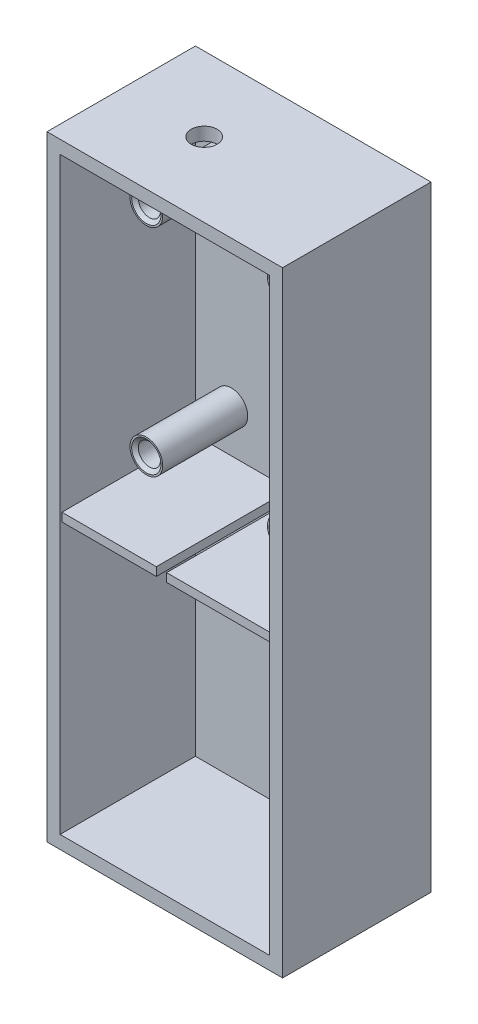
ISO-10303-21;
HEADER;
FILE_DESCRIPTION(('STEP AP214'),'2;1');
FILE_NAME('part.step','',(''),(''),'','','');
FILE_SCHEMA(('AUTOMOTIVE_DESIGN { 1 0 10303 214 1 1 1 1 }'));
ENDSEC;
DATA;
#1=APPLICATION_CONTEXT('core data for automotive mechanical design processes');
#2=APPLICATION_PROTOCOL_DEFINITION('international standard','automotive_design',2000,#1);
#3=PRODUCT_CONTEXT('',#1,'mechanical');
#4=PRODUCT('Part','Part','',(#3));
#5=PRODUCT_RELATED_PRODUCT_CATEGORY('part','',(#4));
#6=PRODUCT_DEFINITION_FORMATION('','',#4);
#7=PRODUCT_DEFINITION_CONTEXT('part definition',#1,'design');
#8=PRODUCT_DEFINITION('design','',#6,#7);
#9=PRODUCT_DEFINITION_SHAPE('','',#8);
#10=(LENGTH_UNIT() NAMED_UNIT(*) SI_UNIT(.MILLI.,.METRE.));
#11=(NAMED_UNIT(*) PLANE_ANGLE_UNIT() SI_UNIT($,.RADIAN.));
#12=(NAMED_UNIT(*) SI_UNIT($,.STERADIAN.) SOLID_ANGLE_UNIT());
#13=UNCERTAINTY_MEASURE_WITH_UNIT(LENGTH_MEASURE(1.E-05),#10,'distance_accuracy_value','');
#14=(GEOMETRIC_REPRESENTATION_CONTEXT(3) GLOBAL_UNCERTAINTY_ASSIGNED_CONTEXT((#13)) GLOBAL_UNIT_ASSIGNED_CONTEXT((#10,
#11,#12)) REPRESENTATION_CONTEXT('',''));
#15=CARTESIAN_POINT('',(0.,0.,0.));
#16=DIRECTION('',(0.,0.,1.));
#17=DIRECTION('',(1.,0.,0.));
#18=AXIS2_PLACEMENT_3D('',#15,#16,#17);
#19=CARTESIAN_POINT('',(13.335,5.08,4.64643362725912));
#20=DIRECTION('',(0.,0.,-1.));
#21=DIRECTION('',(-1.,0.,0.));
#22=AXIS2_PLACEMENT_3D('',#19,#20,#21);
#23=PLANE('',#22);
#24=CARTESIAN_POINT('',(13.335,5.08,4.64643362725912));
#25=DIRECTION('',(0.,0.,1.));
#26=DIRECTION('',(-1.,0.,0.));
#27=AXIS2_PLACEMENT_3D('',#24,#25,#26);
#28=CIRCLE('',#27,3.17500000000001);
#29=CARTESIAN_POINT('',(10.16,5.08,4.64643362725912));
#30=VERTEX_POINT('',#29);
#31=EDGE_CURVE('E259',#30,#30,#28,.T.);
#32=ORIENTED_EDGE('',*,*,#31,.T.);
#33=EDGE_LOOP('',(#32));
#34=FACE_BOUND('',#33,.T.);
#35=CARTESIAN_POINT('',(13.335,5.08,4.64643362725912));
#36=DIRECTION('',(0.,0.,1.));
#37=DIRECTION('',(1.,0.,0.));
#38=AXIS2_PLACEMENT_3D('',#35,#36,#37);
#39=CIRCLE('',#38,2.8448);
#40=CARTESIAN_POINT('',(16.1798,5.08,4.64643362725912));
#41=VERTEX_POINT('',#40);
#42=EDGE_CURVE('E185',#41,#41,#39,.T.);
#43=ORIENTED_EDGE('',*,*,#42,.F.);
#44=EDGE_LOOP('',(#43));
#45=FACE_BOUND('',#44,.T.);
#46=ADVANCED_FACE('F35',(#34,#45),#23,.F.);
#47=CARTESIAN_POINT('',(-20.32,-4.81325837688828,14.0444336272591));
#48=DIRECTION('',(0.,1.,0.));
#49=DIRECTION('',(-1.,0.,0.));
#50=AXIS2_PLACEMENT_3D('',#47,#48,#49);
#51=PLANE('',#50);
#52=DIRECTION('',(1.,0.,0.));
#53=VECTOR('',#52,1.);
#54=CARTESIAN_POINT('',(-20.32,-4.81325837688828,-11.8635663727409));
#55=LINE('',#54,#53);
#56=CARTESIAN_POINT('',(-20.32,-4.81325837688828,-11.8635663727409));
#57=VERTEX_POINT('',#56);
#58=CARTESIAN_POINT('',(-2.00222186234811,-4.81325837688828,-11.8635663727409));
#59=VERTEX_POINT('',#58);
#60=EDGE_CURVE('E233',#57,#59,#55,.T.);
#61=ORIENTED_EDGE('',*,*,#60,.T.);
#62=DIRECTION('',(0.,0.,-1.));
#63=VECTOR('',#62,1.);
#64=CARTESIAN_POINT('',(-2.00222186234811,-4.81325837688828,14.0444336272591));
#65=LINE('',#64,#63);
#66=CARTESIAN_POINT('',(-2.00222186234811,-4.81325837688828,14.0444336272591));
#67=VERTEX_POINT('',#66);
#68=EDGE_CURVE('E203',#67,#59,#65,.T.);
#69=ORIENTED_EDGE('',*,*,#68,.F.);
#70=DIRECTION('',(1.,0.,0.));
#71=VECTOR('',#70,1.);
#72=CARTESIAN_POINT('',(-20.32,-4.81325837688828,14.0444336272591));
#73=LINE('',#72,#71);
#74=CARTESIAN_POINT('',(-20.32,-4.81325837688828,14.0444336272591));
#75=VERTEX_POINT('',#74);
#76=EDGE_CURVE('E223',#75,#67,#73,.T.);
#77=ORIENTED_EDGE('',*,*,#76,.F.);
#78=DIRECTION('',(0.,0.,-1.));
#79=VECTOR('',#78,1.);
#80=CARTESIAN_POINT('',(-20.32,-4.81325837688828,14.0444336272591));
#81=LINE('',#80,#79);
#82=EDGE_CURVE('E244',#75,#57,#81,.T.);
#83=ORIENTED_EDGE('',*,*,#82,.T.);
#84=EDGE_LOOP('',(#61,#69,#77,#83));
#85=FACE_BOUND('',#84,.T.);
#86=ADVANCED_FACE('F381',(#85),#51,.F.);
#87=CARTESIAN_POINT('',(-20.32,-3.17058290765716,14.0444336272591));
#88=DIRECTION('',(0.,-1.,0.));
#89=DIRECTION('',(1.,0.,0.));
#90=AXIS2_PLACEMENT_3D('',#87,#88,#89);
#91=PLANE('',#90);
#92=DIRECTION('',(-1.,0.,0.));
#93=VECTOR('',#92,1.);
#94=CARTESIAN_POINT('',(-20.32,-3.17058290765716,14.0444336272591));
#95=LINE('',#94,#93);
#96=CARTESIAN_POINT('',(-2.00222186234811,-3.17058290765715,14.0444336272591));
#97=VERTEX_POINT('',#96);
#98=CARTESIAN_POINT('',(-20.32,-3.17058290765716,14.0444336272591));
#99=VERTEX_POINT('',#98);
#100=EDGE_CURVE('E228',#97,#99,#95,.T.);
#101=ORIENTED_EDGE('',*,*,#100,.F.);
#102=DIRECTION('',(0.,0.,-1.));
#103=VECTOR('',#102,1.);
#104=CARTESIAN_POINT('',(-2.00222186234811,-3.17058290765716,14.0444336272591));
#105=LINE('',#104,#103);
#106=CARTESIAN_POINT('',(-2.00222186234811,-3.17058290765716,-11.8635663727409));
#107=VERTEX_POINT('',#106);
#108=EDGE_CURVE('E214',#97,#107,#105,.T.);
#109=ORIENTED_EDGE('',*,*,#108,.T.);
#110=DIRECTION('',(-1.,0.,0.));
#111=VECTOR('',#110,1.);
#112=CARTESIAN_POINT('',(-20.32,-3.17058290765716,-11.8635663727409));
#113=LINE('',#112,#111);
#114=CARTESIAN_POINT('',(-20.32,-3.17058290765716,-11.8635663727409));
#115=VERTEX_POINT('',#114);
#116=EDGE_CURVE('E236',#107,#115,#113,.T.);
#117=ORIENTED_EDGE('',*,*,#116,.T.);
#118=DIRECTION('',(0.,0.,-1.));
#119=VECTOR('',#118,1.);
#120=CARTESIAN_POINT('',(-20.32,-3.17058290765716,14.0444336272591));
#121=LINE('',#120,#119);
#122=EDGE_CURVE('E232',#99,#115,#121,.T.);
#123=ORIENTED_EDGE('',*,*,#122,.F.);
#124=EDGE_LOOP('',(#101,#109,#117,#123));
#125=FACE_BOUND('',#124,.T.);
#126=ADVANCED_FACE('F372',(#125),#91,.F.);
#127=CARTESIAN_POINT('',(0.,0.,14.0444336272591));
#128=DIRECTION('',(0.,0.,1.));
#129=DIRECTION('',(1.,0.,0.));
#130=AXIS2_PLACEMENT_3D('',#127,#128,#129);
#131=PLANE('',#130);
#132=DIRECTION('',(0.,-1.,0.));
#133=VECTOR('',#132,1.);
#134=CARTESIAN_POINT('',(-2.00222186234811,0.,14.0444336272591));
#135=LINE('',#134,#133);
#136=EDGE_CURVE('E11',#97,#67,#135,.T.);
#137=ORIENTED_EDGE('',*,*,#136,.F.);
#138=ORIENTED_EDGE('',*,*,#100,.T.);
#139=DIRECTION('',(0.,-1.,0.));
#140=VECTOR('',#139,1.);
#141=CARTESIAN_POINT('',(-20.32,-3.17058290765716,14.0444336272591));
#142=LINE('',#141,#140);
#143=EDGE_CURVE('E218',#99,#75,#142,.T.);
#144=ORIENTED_EDGE('',*,*,#143,.T.);
#145=ORIENTED_EDGE('',*,*,#76,.T.);
#146=EDGE_LOOP('',(#137,#138,#144,#145));
#147=FACE_BOUND('',#146,.T.);
#148=ADVANCED_FACE('F378',(#147),#131,.T.);
#149=CARTESIAN_POINT('',(-20.32,59.69,14.4035663727409));
#150=DIRECTION('',(1.,0.,0.));
#151=DIRECTION('',(0.,1.,0.));
#152=AXIS2_PLACEMENT_3D('',#149,#150,#151);
#153=PLANE('',#152);
#154=DIRECTION('',(0.,-1.,0.));
#155=VECTOR('',#154,1.);
#156=CARTESIAN_POINT('',(-20.32,59.69,-11.8635663727409));
#157=LINE('',#156,#155);
#158=CARTESIAN_POINT('',(-20.32,-57.15,-11.8635663727409));
#159=VERTEX_POINT('',#158);
#160=EDGE_CURVE('E274',#57,#159,#157,.T.);
#161=ORIENTED_EDGE('',*,*,#160,.F.);
#162=ORIENTED_EDGE('',*,*,#82,.F.);
#163=ORIENTED_EDGE('',*,*,#143,.F.);
#164=ORIENTED_EDGE('',*,*,#122,.T.);
#165=CARTESIAN_POINT('',(-20.32,57.15,-11.8635663727409));
#166=VERTEX_POINT('',#165);
#167=EDGE_CURVE('E277',#166,#115,#157,.T.);
#168=ORIENTED_EDGE('',*,*,#167,.F.);
#169=DIRECTION('',(0.,0.,-1.));
#170=VECTOR('',#169,1.);
#171=CARTESIAN_POINT('',(-20.32,57.15,14.4035663727409));
#172=LINE('',#171,#170);
#173=CARTESIAN_POINT('',(-20.32,57.15,14.4035663727409));
#174=VERTEX_POINT('',#173);
#175=EDGE_CURVE('E286',#174,#166,#172,.T.);
#176=ORIENTED_EDGE('',*,*,#175,.F.);
#177=DIRECTION('',(0.,-1.,0.));
#178=VECTOR('',#177,1.);
#179=CARTESIAN_POINT('',(-20.32,59.69,14.4035663727409));
#180=LINE('',#179,#178);
#181=CARTESIAN_POINT('',(-20.32,-57.15,14.4035663727409));
#182=VERTEX_POINT('',#181);
#183=EDGE_CURVE('E302',#174,#182,#180,.T.);
#184=ORIENTED_EDGE('',*,*,#183,.T.);
#185=DIRECTION('',(0.,0.,-1.));
#186=VECTOR('',#185,1.);
#187=CARTESIAN_POINT('',(-20.32,-57.15,14.4035663727409));
#188=LINE('',#187,#186);
#189=EDGE_CURVE('E281',#182,#159,#188,.T.);
#190=ORIENTED_EDGE('',*,*,#189,.T.);
#191=EDGE_LOOP('',(#161,#162,#163,#164,#168,#176,#184,#190));
#192=FACE_BOUND('',#191,.T.);
#193=ADVANCED_FACE('F366',(#192),#153,.T.);
#194=CARTESIAN_POINT('',(20.32,59.69,14.4035663727409));
#195=DIRECTION('',(1.,0.,0.));
#196=DIRECTION('',(0.,1.,0.));
#197=AXIS2_PLACEMENT_3D('',#194,#195,#196);
#198=PLANE('',#197);
#199=DIRECTION('',(0.,0.,-1.));
#200=VECTOR('',#199,1.);
#201=CARTESIAN_POINT('',(20.32,-4.81325837688828,14.0444336272591));
#202=LINE('',#201,#200);
#203=CARTESIAN_POINT('',(20.32,-4.81325837688828,14.0444336272591));
#204=VERTEX_POINT('',#203);
#205=CARTESIAN_POINT('',(20.32,-4.81325837688828,-11.8635663727409));
#206=VERTEX_POINT('',#205);
#207=EDGE_CURVE('E241',#204,#206,#202,.T.);
#208=ORIENTED_EDGE('',*,*,#207,.T.);
#209=DIRECTION('',(0.,-1.,0.));
#210=VECTOR('',#209,1.);
#211=CARTESIAN_POINT('',(20.32,59.69,-11.8635663727409));
#212=LINE('',#211,#210);
#213=CARTESIAN_POINT('',(20.32,-57.15,-11.8635663727409));
#214=VERTEX_POINT('',#213);
#215=EDGE_CURVE('E292',#206,#214,#212,.T.);
#216=ORIENTED_EDGE('',*,*,#215,.T.);
#217=DIRECTION('',(0.,0.,-1.));
#218=VECTOR('',#217,1.);
#219=CARTESIAN_POINT('',(20.32,-57.15,14.4035663727409));
#220=LINE('',#219,#218);
#221=CARTESIAN_POINT('',(20.32,-57.15,14.4035663727409));
#222=VERTEX_POINT('',#221);
#223=EDGE_CURVE('E285',#222,#214,#220,.T.);
#224=ORIENTED_EDGE('',*,*,#223,.F.);
#225=DIRECTION('',(0.,-1.,0.));
#226=VECTOR('',#225,1.);
#227=CARTESIAN_POINT('',(20.32,59.69,14.4035663727409));
#228=LINE('',#227,#226);
#229=CARTESIAN_POINT('',(20.32,57.15,14.4035663727409));
#230=VERTEX_POINT('',#229);
#231=EDGE_CURVE('E306',#230,#222,#228,.T.);
#232=ORIENTED_EDGE('',*,*,#231,.F.);
#233=DIRECTION('',(0.,0.,-1.));
#234=VECTOR('',#233,1.);
#235=CARTESIAN_POINT('',(20.32,57.15,14.4035663727409));
#236=LINE('',#235,#234);
#237=CARTESIAN_POINT('',(20.32,57.15,-11.8635663727409));
#238=VERTEX_POINT('',#237);
#239=EDGE_CURVE('E288',#230,#238,#236,.T.);
#240=ORIENTED_EDGE('',*,*,#239,.T.);
#241=CARTESIAN_POINT('',(20.32,-3.17058290765716,-11.8635663727409));
#242=VERTEX_POINT('',#241);
#243=EDGE_CURVE('E295',#238,#242,#212,.T.);
#244=ORIENTED_EDGE('',*,*,#243,.T.);
#245=DIRECTION('',(0.,0.,-1.));
#246=VECTOR('',#245,1.);
#247=CARTESIAN_POINT('',(20.32,-3.17058290765715,14.0444336272591));
#248=LINE('',#247,#246);
#249=CARTESIAN_POINT('',(20.32,-3.17058290765715,14.0444336272591));
#250=VERTEX_POINT('',#249);
#251=EDGE_CURVE('E58',#250,#242,#248,.T.);
#252=ORIENTED_EDGE('',*,*,#251,.F.);
#253=DIRECTION('',(0.,1.,0.));
#254=VECTOR('',#253,1.);
#255=CARTESIAN_POINT('',(20.32,-3.17058290765715,14.0444336272591));
#256=LINE('',#255,#254);
#257=EDGE_CURVE('E226',#204,#250,#256,.T.);
#258=ORIENTED_EDGE('',*,*,#257,.F.);
#259=EDGE_LOOP('',(#208,#216,#224,#232,#240,#244,#252,#258));
#260=FACE_BOUND('',#259,.T.);
#261=ADVANCED_FACE('F350',(#260),#198,.F.);
#262=CARTESIAN_POINT('',(0.,0.,-11.8635663727409));
#263=DIRECTION('',(0.,0.,1.));
#264=DIRECTION('',(1.,0.,0.));
#265=AXIS2_PLACEMENT_3D('',#262,#263,#264);
#266=PLANE('',#265);
#267=ORIENTED_EDGE('',*,*,#116,.F.);
#268=DIRECTION('',(0.,-1.,0.));
#269=VECTOR('',#268,1.);
#270=CARTESIAN_POINT('',(-2.00222186234811,10.9347416231117,-11.8635663727409));
#271=LINE('',#270,#269);
#272=EDGE_CURVE('E207',#107,#59,#271,.T.);
#273=ORIENTED_EDGE('',*,*,#272,.T.);
#274=ORIENTED_EDGE('',*,*,#60,.F.);
#275=ORIENTED_EDGE('',*,*,#160,.T.);
#276=DIRECTION('',(1.,0.,0.));
#277=VECTOR('',#276,1.);
#278=CARTESIAN_POINT('',(-22.86,-57.15,-11.8635663727409));
#279=LINE('',#278,#277);
#280=EDGE_CURVE('E280',#159,#214,#279,.T.);
#281=ORIENTED_EDGE('',*,*,#280,.T.);
#282=ORIENTED_EDGE('',*,*,#215,.F.);
#283=CARTESIAN_POINT('',(0.,-4.81325837688828,-11.8635663727409));
#284=VERTEX_POINT('',#283);
#285=EDGE_CURVE('E217',#284,#206,#55,.T.);
#286=ORIENTED_EDGE('',*,*,#285,.F.);
#287=DIRECTION('',(0.,-1.,0.));
#288=VECTOR('',#287,1.);
#289=CARTESIAN_POINT('',(0.,10.9347416231117,-11.8635663727409));
#290=LINE('',#289,#288);
#291=CARTESIAN_POINT('',(0.,-3.17058290765716,-11.8635663727409));
#292=VERTEX_POINT('',#291);
#293=EDGE_CURVE('E208',#292,#284,#290,.T.);
#294=ORIENTED_EDGE('',*,*,#293,.F.);
#295=EDGE_CURVE('E222',#242,#292,#113,.T.);
#296=ORIENTED_EDGE('',*,*,#295,.F.);
#297=ORIENTED_EDGE('',*,*,#243,.F.);
#298=DIRECTION('',(1.,0.,0.));
#299=VECTOR('',#298,1.);
#300=CARTESIAN_POINT('',(-22.86,57.15,-11.8635663727409));
#301=LINE('',#300,#299);
#302=EDGE_CURVE('E298',#166,#238,#301,.T.);
#303=ORIENTED_EDGE('',*,*,#302,.F.);
#304=ORIENTED_EDGE('',*,*,#167,.T.);
#305=EDGE_LOOP('',(#267,#273,#274,#275,#281,#282,#286,#294,#296,#297,#303,#304));
#306=FACE_BOUND('',#305,.T.);
#307=CARTESIAN_POINT('',(-13.335,5.08,-11.8635663727409));
#308=DIRECTION('',(0.,0.,1.));
#309=DIRECTION('',(-1.,0.,0.));
#310=AXIS2_PLACEMENT_3D('',#307,#308,#309);
#311=CIRCLE('',#310,3.175);
#312=CARTESIAN_POINT('',(-16.51,5.08,-11.8635663727409));
#313=VERTEX_POINT('',#312);
#314=EDGE_CURVE('E252',#313,#313,#311,.T.);
#315=ORIENTED_EDGE('',*,*,#314,.F.);
#316=EDGE_LOOP('',(#315));
#317=FACE_BOUND('',#316,.T.);
#318=CARTESIAN_POINT('',(13.335,5.08,-11.8635663727409));
#319=DIRECTION('',(0.,0.,1.));
#320=DIRECTION('',(-1.,0.,0.));
#321=AXIS2_PLACEMENT_3D('',#318,#319,#320);
#322=CIRCLE('',#321,3.17500000000001);
#323=CARTESIAN_POINT('',(10.16,5.08,-11.8635663727409));
#324=VERTEX_POINT('',#323);
#325=EDGE_CURVE('E256',#324,#324,#322,.T.);
#326=ORIENTED_EDGE('',*,*,#325,.F.);
#327=EDGE_LOOP('',(#326));
#328=FACE_BOUND('',#327,.T.);
#329=CARTESIAN_POINT('',(13.335,46.99,-11.8635663727409));
#330=DIRECTION('',(0.,0.,1.));
#331=DIRECTION('',(1.,0.,0.));
#332=AXIS2_PLACEMENT_3D('',#329,#330,#331);
#333=CIRCLE('',#332,3.175);
#334=CARTESIAN_POINT('',(16.51,46.99,-11.8635663727409));
#335=VERTEX_POINT('',#334);
#336=EDGE_CURVE('E262',#335,#335,#333,.T.);
#337=ORIENTED_EDGE('',*,*,#336,.F.);
#338=EDGE_LOOP('',(#337));
#339=FACE_BOUND('',#338,.T.);
#340=CARTESIAN_POINT('',(-13.335,46.99,-11.8635663727409));
#341=DIRECTION('',(0.,0.,1.));
#342=DIRECTION('',(1.,0.,0.));
#343=AXIS2_PLACEMENT_3D('',#340,#341,#342);
#344=CIRCLE('',#343,3.175);
#345=CARTESIAN_POINT('',(-10.16,46.99,-11.8635663727409));
#346=VERTEX_POINT('',#345);
#347=EDGE_CURVE('E268',#346,#346,#344,.T.);
#348=ORIENTED_EDGE('',*,*,#347,.F.);
#349=EDGE_LOOP('',(#348));
#350=FACE_BOUND('',#349,.T.);
#351=ADVANCED_FACE('F357',(#306,#317,#328,#339,#350),#266,.T.);
#352=CARTESIAN_POINT('',(-22.86,59.69,14.4035663727409));
#353=DIRECTION('',(1.,0.,0.));
#354=DIRECTION('',(0.,1.,0.));
#355=AXIS2_PLACEMENT_3D('',#352,#353,#354);
#356=PLANE('',#355);
#357=DIRECTION('',(0.,-1.,0.));
#358=VECTOR('',#357,1.);
#359=CARTESIAN_POINT('',(-22.86,59.69,-14.4035663727409));
#360=LINE('',#359,#358);
#361=CARTESIAN_POINT('',(-22.86,59.69,-14.4035663727409));
#362=VERTEX_POINT('',#361);
#363=CARTESIAN_POINT('',(-22.86,-59.69,-14.4035663727409));
#364=VERTEX_POINT('',#363);
#365=EDGE_CURVE('E284',#362,#364,#360,.T.);
#366=ORIENTED_EDGE('',*,*,#365,.T.);
#367=DIRECTION('',(0.,0.,-1.));
#368=VECTOR('',#367,1.);
#369=CARTESIAN_POINT('',(-22.86,-59.69,14.4035663727409));
#370=LINE('',#369,#368);
#371=CARTESIAN_POINT('',(-22.86,-59.69,14.4035663727409));
#372=VERTEX_POINT('',#371);
#373=EDGE_CURVE('E339',#372,#364,#370,.T.);
#374=ORIENTED_EDGE('',*,*,#373,.F.);
#375=DIRECTION('',(0.,-1.,0.));
#376=VECTOR('',#375,1.);
#377=CARTESIAN_POINT('',(-22.86,59.69,14.4035663727409));
#378=LINE('',#377,#376);
#379=CARTESIAN_POINT('',(-22.86,59.69,14.4035663727409));
#380=VERTEX_POINT('',#379);
#381=EDGE_CURVE('E311',#380,#372,#378,.T.);
#382=ORIENTED_EDGE('',*,*,#381,.F.);
#383=DIRECTION('',(0.,0.,-1.));
#384=VECTOR('',#383,1.);
#385=CARTESIAN_POINT('',(-22.86,59.69,14.4035663727409));
#386=LINE('',#385,#384);
#387=EDGE_CURVE('E323',#380,#362,#386,.T.);
#388=ORIENTED_EDGE('',*,*,#387,.T.);
#389=EDGE_LOOP('',(#366,#374,#382,#388));
#390=FACE_BOUND('',#389,.T.);
#391=ADVANCED_FACE('F37',(#390),#356,.F.);
#392=CARTESIAN_POINT('',(-22.86,-59.69,14.4035663727409));
#393=DIRECTION('',(0.,1.,0.));
#394=DIRECTION('',(0.,0.,1.));
#395=AXIS2_PLACEMENT_3D('',#392,#393,#394);
#396=PLANE('',#395);
#397=DIRECTION('',(1.,0.,0.));
#398=VECTOR('',#397,1.);
#399=CARTESIAN_POINT('',(-22.86,-59.69,-14.4035663727409));
#400=LINE('',#399,#398);
#401=CARTESIAN_POINT('',(22.86,-59.69,-14.4035663727409));
#402=VERTEX_POINT('',#401);
#403=EDGE_CURVE('E326',#364,#402,#400,.T.);
#404=ORIENTED_EDGE('',*,*,#403,.T.);
#405=DIRECTION('',(0.,0.,-1.));
#406=VECTOR('',#405,1.);
#407=CARTESIAN_POINT('',(22.86,-59.69,14.4035663727409));
#408=LINE('',#407,#406);
#409=CARTESIAN_POINT('',(22.86,-59.69,14.4035663727409));
#410=VERTEX_POINT('',#409);
#411=EDGE_CURVE('E337',#410,#402,#408,.T.);
#412=ORIENTED_EDGE('',*,*,#411,.F.);
#413=DIRECTION('',(1.,0.,0.));
#414=VECTOR('',#413,1.);
#415=CARTESIAN_POINT('',(-22.86,-59.69,14.4035663727409));
#416=LINE('',#415,#414);
#417=EDGE_CURVE('E314',#372,#410,#416,.T.);
#418=ORIENTED_EDGE('',*,*,#417,.F.);
#419=ORIENTED_EDGE('',*,*,#373,.T.);
#420=EDGE_LOOP('',(#404,#412,#418,#419));
#421=FACE_BOUND('',#420,.T.);
#422=ADVANCED_FACE('F459',(#421),#396,.F.);
#423=CARTESIAN_POINT('',(22.86,59.69,14.4035663727409));
#424=DIRECTION('',(1.,0.,0.));
#425=DIRECTION('',(0.,1.,0.));
#426=AXIS2_PLACEMENT_3D('',#423,#424,#425);
#427=PLANE('',#426);
#428=DIRECTION('',(0.,-1.,0.));
#429=VECTOR('',#428,1.);
#430=CARTESIAN_POINT('',(22.86,59.69,-14.4035663727409));
#431=LINE('',#430,#429);
#432=CARTESIAN_POINT('',(22.86,59.69,-14.4035663727409));
#433=VERTEX_POINT('',#432);
#434=EDGE_CURVE('E329',#433,#402,#431,.T.);
#435=ORIENTED_EDGE('',*,*,#434,.F.);
#436=DIRECTION('',(0.,0.,-1.));
#437=VECTOR('',#436,1.);
#438=CARTESIAN_POINT('',(22.86,59.69,14.4035663727409));
#439=LINE('',#438,#437);
#440=CARTESIAN_POINT('',(22.86,59.69,14.4035663727409));
#441=VERTEX_POINT('',#440);
#442=EDGE_CURVE('E335',#441,#433,#439,.T.);
#443=ORIENTED_EDGE('',*,*,#442,.F.);
#444=DIRECTION('',(0.,-1.,0.));
#445=VECTOR('',#444,1.);
#446=CARTESIAN_POINT('',(22.86,59.69,14.4035663727409));
#447=LINE('',#446,#445);
#448=EDGE_CURVE('E317',#441,#410,#447,.T.);
#449=ORIENTED_EDGE('',*,*,#448,.T.);
#450=ORIENTED_EDGE('',*,*,#411,.T.);
#451=EDGE_LOOP('',(#435,#443,#449,#450));
#452=FACE_BOUND('',#451,.T.);
#453=ADVANCED_FACE('F456',(#452),#427,.T.);
#454=CARTESIAN_POINT('',(-22.86,59.69,14.4035663727409));
#455=DIRECTION('',(0.,1.,0.));
#456=DIRECTION('',(0.,0.,1.));
#457=AXIS2_PLACEMENT_3D('',#454,#455,#456);
#458=PLANE('',#457);
#459=CARTESIAN_POINT('',(-6.76186189694035,59.69,0.));
#460=DIRECTION('',(0.,1.,0.));
#461=DIRECTION('',(0.,0.,1.));
#462=AXIS2_PLACEMENT_3D('',#459,#460,#461);
#463=CIRCLE('',#462,2.52729999999999);
#464=CARTESIAN_POINT('',(-6.76186189694035,59.69,2.52729999999999));
#465=VERTEX_POINT('',#464);
#466=EDGE_CURVE('E246',#465,#465,#463,.T.);
#467=ORIENTED_EDGE('',*,*,#466,.F.);
#468=EDGE_LOOP('',(#467));
#469=FACE_BOUND('',#468,.T.);
#470=DIRECTION('',(1.,0.,0.));
#471=VECTOR('',#470,1.);
#472=CARTESIAN_POINT('',(-22.86,59.69,-14.4035663727409));
#473=LINE('',#472,#471);
#474=EDGE_CURVE('E315',#362,#433,#473,.T.);
#475=ORIENTED_EDGE('',*,*,#474,.F.);
#476=ORIENTED_EDGE('',*,*,#387,.F.);
#477=DIRECTION('',(1.,0.,0.));
#478=VECTOR('',#477,1.);
#479=CARTESIAN_POINT('',(-22.86,59.69,14.4035663727409));
#480=LINE('',#479,#478);
#481=EDGE_CURVE('E320',#380,#441,#480,.T.);
#482=ORIENTED_EDGE('',*,*,#481,.T.);
#483=ORIENTED_EDGE('',*,*,#442,.T.);
#484=EDGE_LOOP('',(#475,#476,#482,#483));
#485=FACE_BOUND('',#484,.T.);
#486=ADVANCED_FACE('F450',(#469,#485),#458,.T.);
#487=CARTESIAN_POINT('',(0.,0.,14.4035663727409));
#488=DIRECTION('',(0.,0.,1.));
#489=DIRECTION('',(1.,0.,0.));
#490=AXIS2_PLACEMENT_3D('',#487,#488,#489);
#491=PLANE('',#490);
#492=ORIENTED_EDGE('',*,*,#183,.F.);
#493=DIRECTION('',(1.,0.,0.));
#494=VECTOR('',#493,1.);
#495=CARTESIAN_POINT('',(-22.86,57.15,14.4035663727409));
#496=LINE('',#495,#494);
#497=EDGE_CURVE('E289',#174,#230,#496,.T.);
#498=ORIENTED_EDGE('',*,*,#497,.T.);
#499=ORIENTED_EDGE('',*,*,#231,.T.);
#500=DIRECTION('',(1.,0.,0.));
#501=VECTOR('',#500,1.);
#502=CARTESIAN_POINT('',(-22.86,-57.15,14.4035663727409));
#503=LINE('',#502,#501);
#504=EDGE_CURVE('E304',#182,#222,#503,.T.);
#505=ORIENTED_EDGE('',*,*,#504,.F.);
#506=EDGE_LOOP('',(#492,#498,#499,#505));
#507=FACE_BOUND('',#506,.T.);
#508=ORIENTED_EDGE('',*,*,#381,.T.);
#509=ORIENTED_EDGE('',*,*,#417,.T.);
#510=ORIENTED_EDGE('',*,*,#448,.F.);
#511=ORIENTED_EDGE('',*,*,#481,.F.);
#512=EDGE_LOOP('',(#508,#509,#510,#511));
#513=FACE_BOUND('',#512,.T.);
#514=ADVANCED_FACE('F389',(#507,#513),#491,.T.);
#515=CARTESIAN_POINT('',(0.,0.,-14.4035663727409));
#516=DIRECTION('',(0.,0.,1.));
#517=DIRECTION('',(1.,0.,0.));
#518=AXIS2_PLACEMENT_3D('',#515,#516,#517);
#519=PLANE('',#518);
#520=ORIENTED_EDGE('',*,*,#365,.F.);
#521=ORIENTED_EDGE('',*,*,#474,.T.);
#522=ORIENTED_EDGE('',*,*,#434,.T.);
#523=ORIENTED_EDGE('',*,*,#403,.F.);
#524=EDGE_LOOP('',(#520,#521,#522,#523));
#525=FACE_BOUND('',#524,.T.);
#526=ADVANCED_FACE('F440',(#525),#519,.F.);
#527=CARTESIAN_POINT('',(-22.86,-57.15,14.4035663727409));
#528=DIRECTION('',(0.,1.,0.));
#529=DIRECTION('',(0.,0.,1.));
#530=AXIS2_PLACEMENT_3D('',#527,#528,#529);
#531=PLANE('',#530);
#532=ORIENTED_EDGE('',*,*,#280,.F.);
#533=ORIENTED_EDGE('',*,*,#189,.F.);
#534=ORIENTED_EDGE('',*,*,#504,.T.);
#535=ORIENTED_EDGE('',*,*,#223,.T.);
#536=EDGE_LOOP('',(#532,#533,#534,#535));
#537=FACE_BOUND('',#536,.T.);
#538=ADVANCED_FACE('F386',(#537),#531,.T.);
#539=CARTESIAN_POINT('',(-22.86,57.15,14.4035663727409));
#540=DIRECTION('',(0.,1.,0.));
#541=DIRECTION('',(0.,0.,1.));
#542=AXIS2_PLACEMENT_3D('',#539,#540,#541);
#543=PLANE('',#542);
#544=CARTESIAN_POINT('',(-6.76186189694035,57.15,0.));
#545=DIRECTION('',(0.,1.,0.));
#546=DIRECTION('',(0.,0.,1.));
#547=AXIS2_PLACEMENT_3D('',#544,#545,#546);
#548=CIRCLE('',#547,2.52729999999999);
#549=CARTESIAN_POINT('',(-6.76186189694035,57.15,2.52729999999999));
#550=VERTEX_POINT('',#549);
#551=EDGE_CURVE('E249',#550,#550,#548,.T.);
#552=ORIENTED_EDGE('',*,*,#551,.T.);
#553=EDGE_LOOP('',(#552));
#554=FACE_BOUND('',#553,.T.);
#555=ORIENTED_EDGE('',*,*,#302,.T.);
#556=ORIENTED_EDGE('',*,*,#239,.F.);
#557=ORIENTED_EDGE('',*,*,#497,.F.);
#558=ORIENTED_EDGE('',*,*,#175,.T.);
#559=EDGE_LOOP('',(#555,#556,#557,#558));
#560=FACE_BOUND('',#559,.T.);
#561=ADVANCED_FACE('F360',(#554,#560),#543,.F.);
#562=CARTESIAN_POINT('',(-13.335,46.99,4.64643362725912));
#563=DIRECTION('',(0.,0.,-1.));
#564=DIRECTION('',(-1.,0.,0.));
#565=AXIS2_PLACEMENT_3D('',#562,#563,#564);
#566=CYLINDRICAL_SURFACE('',#565,3.175);
#567=CARTESIAN_POINT('',(-13.335,46.99,4.64643362725912));
#568=DIRECTION('',(0.,0.,1.));
#569=DIRECTION('',(1.,0.,0.));
#570=AXIS2_PLACEMENT_3D('',#567,#568,#569);
#571=CIRCLE('',#570,3.175);
#572=CARTESIAN_POINT('',(-10.16,46.99,4.64643362725912));
#573=VERTEX_POINT('',#572);
#574=EDGE_CURVE('E271',#573,#573,#571,.T.);
#575=ORIENTED_EDGE('',*,*,#574,.F.);
#576=EDGE_LOOP('',(#575));
#577=FACE_BOUND('',#576,.T.);
#578=ORIENTED_EDGE('',*,*,#347,.T.);
#579=EDGE_LOOP('',(#578));
#580=FACE_BOUND('',#579,.T.);
#581=ADVANCED_FACE('F431',(#577,#580),#566,.T.);
#582=CARTESIAN_POINT('',(-13.335,46.99,4.64643362725912));
#583=DIRECTION('',(0.,0.,1.));
#584=DIRECTION('',(1.,0.,0.));
#585=AXIS2_PLACEMENT_3D('',#582,#583,#584);
#586=PLANE('',#585);
#587=CARTESIAN_POINT('',(-13.335,46.99,4.64643362725912));
#588=DIRECTION('',(0.,0.,1.));
#589=DIRECTION('',(1.,0.,0.));
#590=AXIS2_PLACEMENT_3D('',#587,#588,#589);
#591=CIRCLE('',#590,2.8448);
#592=CARTESIAN_POINT('',(-10.4902,46.99,4.64643362725912));
#593=VERTEX_POINT('',#592);
#594=EDGE_CURVE('E169',#593,#593,#591,.T.);
#595=ORIENTED_EDGE('',*,*,#594,.F.);
#596=EDGE_LOOP('',(#595));
#597=FACE_BOUND('',#596,.T.);
#598=ORIENTED_EDGE('',*,*,#574,.T.);
#599=EDGE_LOOP('',(#598));
#600=FACE_BOUND('',#599,.T.);
#601=ADVANCED_FACE('F427',(#597,#600),#586,.T.);
#602=CARTESIAN_POINT('',(13.335,46.99,4.64643362725912));
#603=DIRECTION('',(0.,0.,-1.));
#604=DIRECTION('',(-1.,0.,0.));
#605=AXIS2_PLACEMENT_3D('',#602,#603,#604);
#606=CYLINDRICAL_SURFACE('',#605,3.175);
#607=CARTESIAN_POINT('',(13.335,46.99,4.64643362725912));
#608=DIRECTION('',(0.,0.,1.));
#609=DIRECTION('',(1.,0.,0.));
#610=AXIS2_PLACEMENT_3D('',#607,#608,#609);
#611=CIRCLE('',#610,3.175);
#612=CARTESIAN_POINT('',(16.51,46.99,4.64643362725912));
#613=VERTEX_POINT('',#612);
#614=EDGE_CURVE('E265',#613,#613,#611,.T.);
#615=ORIENTED_EDGE('',*,*,#614,.F.);
#616=EDGE_LOOP('',(#615));
#617=FACE_BOUND('',#616,.T.);
#618=ORIENTED_EDGE('',*,*,#336,.T.);
#619=EDGE_LOOP('',(#618));
#620=FACE_BOUND('',#619,.T.);
#621=ADVANCED_FACE('F423',(#617,#620),#606,.T.);
#622=CARTESIAN_POINT('',(13.335,46.99,4.64643362725912));
#623=DIRECTION('',(0.,0.,1.));
#624=DIRECTION('',(1.,0.,0.));
#625=AXIS2_PLACEMENT_3D('',#622,#623,#624);
#626=PLANE('',#625);
#627=CARTESIAN_POINT('',(13.335,46.99,4.64643362725912));
#628=DIRECTION('',(0.,0.,1.));
#629=DIRECTION('',(1.,0.,0.));
#630=AXIS2_PLACEMENT_3D('',#627,#628,#629);
#631=CIRCLE('',#630,2.8448);
#632=CARTESIAN_POINT('',(16.1798,46.99,4.64643362725912));
#633=VERTEX_POINT('',#632);
#634=EDGE_CURVE('E194',#633,#633,#631,.T.);
#635=ORIENTED_EDGE('',*,*,#634,.F.);
#636=EDGE_LOOP('',(#635));
#637=FACE_BOUND('',#636,.T.);
#638=ORIENTED_EDGE('',*,*,#614,.T.);
#639=EDGE_LOOP('',(#638));
#640=FACE_BOUND('',#639,.T.);
#641=ADVANCED_FACE('F419',(#637,#640),#626,.T.);
#642=CARTESIAN_POINT('',(13.335,5.08,4.64643362725912));
#643=DIRECTION('',(0.,0.,-1.));
#644=DIRECTION('',(-1.,0.,0.));
#645=AXIS2_PLACEMENT_3D('',#642,#643,#644);
#646=CYLINDRICAL_SURFACE('',#645,3.17500000000001);
#647=ORIENTED_EDGE('',*,*,#31,.F.);
#648=EDGE_LOOP('',(#647));
#649=FACE_BOUND('',#648,.T.);
#650=ORIENTED_EDGE('',*,*,#325,.T.);
#651=EDGE_LOOP('',(#650));
#652=FACE_BOUND('',#651,.T.);
#653=ADVANCED_FACE('F416',(#649,#652),#646,.T.);
#654=CARTESIAN_POINT('',(-13.335,5.08,4.64643362725912));
#655=DIRECTION('',(0.,0.,-1.));
#656=DIRECTION('',(-1.,0.,0.));
#657=AXIS2_PLACEMENT_3D('',#654,#655,#656);
#658=CYLINDRICAL_SURFACE('',#657,3.175);
#659=CARTESIAN_POINT('',(-13.335,5.08,4.64643362725912));
#660=DIRECTION('',(0.,0.,1.));
#661=DIRECTION('',(-1.,0.,0.));
#662=AXIS2_PLACEMENT_3D('',#659,#660,#661);
#663=CIRCLE('',#662,3.175);
#664=CARTESIAN_POINT('',(-16.51,5.08,4.64643362725912));
#665=VERTEX_POINT('',#664);
#666=EDGE_CURVE('E253',#665,#665,#663,.T.);
#667=ORIENTED_EDGE('',*,*,#666,.F.);
#668=EDGE_LOOP('',(#667));
#669=FACE_BOUND('',#668,.T.);
#670=ORIENTED_EDGE('',*,*,#314,.T.);
#671=EDGE_LOOP('',(#670));
#672=FACE_BOUND('',#671,.T.);
#673=ADVANCED_FACE('F414',(#669,#672),#658,.T.);
#674=CARTESIAN_POINT('',(-13.335,5.08,4.64643362725912));
#675=DIRECTION('',(0.,0.,-1.));
#676=DIRECTION('',(-1.,0.,0.));
#677=AXIS2_PLACEMENT_3D('',#674,#675,#676);
#678=PLANE('',#677);
#679=CARTESIAN_POINT('',(-13.335,5.08,4.64643362725912));
#680=DIRECTION('',(0.,0.,1.));
#681=DIRECTION('',(1.,0.,0.));
#682=AXIS2_PLACEMENT_3D('',#679,#680,#681);
#683=CIRCLE('',#682,2.8448);
#684=CARTESIAN_POINT('',(-10.4902,5.08,4.64643362725912));
#685=VERTEX_POINT('',#684);
#686=EDGE_CURVE('E176',#685,#685,#683,.T.);
#687=ORIENTED_EDGE('',*,*,#686,.F.);
#688=EDGE_LOOP('',(#687));
#689=FACE_BOUND('',#688,.T.);
#690=ORIENTED_EDGE('',*,*,#666,.T.);
#691=EDGE_LOOP('',(#690));
#692=FACE_BOUND('',#691,.T.);
#693=ADVANCED_FACE('F402',(#689,#692),#678,.F.);
#694=CARTESIAN_POINT('',(-6.76186189694035,59.69,0.));
#695=DIRECTION('',(0.,1.,0.));
#696=DIRECTION('',(0.,0.,1.));
#697=AXIS2_PLACEMENT_3D('',#694,#695,#696);
#698=CYLINDRICAL_SURFACE('',#697,2.52729999999999);
#699=ORIENTED_EDGE('',*,*,#551,.F.);
#700=EDGE_LOOP('',(#699));
#701=FACE_BOUND('',#700,.T.);
#702=ORIENTED_EDGE('',*,*,#466,.T.);
#703=EDGE_LOOP('',(#702));
#704=FACE_BOUND('',#703,.T.);
#705=ADVANCED_FACE('F395',(#701,#704),#698,.F.);
#706=CARTESIAN_POINT('',(0.,-4.81325837688828,14.0444336272591));
#707=VERTEX_POINT('',#706);
#708=EDGE_CURVE('E221',#707,#204,#73,.T.);
#709=ORIENTED_EDGE('',*,*,#708,.F.);
#710=DIRECTION('',(0.,0.,1.));
#711=VECTOR('',#710,1.);
#712=CARTESIAN_POINT('',(0.,-4.81325837688828,14.0444336272591));
#713=LINE('',#712,#711);
#714=EDGE_CURVE('E50',#284,#707,#713,.T.);
#715=ORIENTED_EDGE('',*,*,#714,.F.);
#716=ORIENTED_EDGE('',*,*,#285,.T.);
#717=ORIENTED_EDGE('',*,*,#207,.F.);
#718=EDGE_LOOP('',(#709,#715,#716,#717));
#719=FACE_BOUND('',#718,.T.);
#720=ADVANCED_FACE('F393',(#719),#51,.F.);
#721=ORIENTED_EDGE('',*,*,#295,.T.);
#722=DIRECTION('',(0.,0.,1.));
#723=VECTOR('',#722,1.);
#724=CARTESIAN_POINT('',(0.,-3.17058290765716,14.0444336272591));
#725=LINE('',#724,#723);
#726=CARTESIAN_POINT('',(0.,-3.17058290765715,14.0444336272591));
#727=VERTEX_POINT('',#726);
#728=EDGE_CURVE('E210',#292,#727,#725,.T.);
#729=ORIENTED_EDGE('',*,*,#728,.T.);
#730=EDGE_CURVE('E229',#250,#727,#95,.T.);
#731=ORIENTED_EDGE('',*,*,#730,.F.);
#732=ORIENTED_EDGE('',*,*,#251,.T.);
#733=EDGE_LOOP('',(#721,#729,#731,#732));
#734=FACE_BOUND('',#733,.T.);
#735=ADVANCED_FACE('F345',(#734),#91,.F.);
#736=DIRECTION('',(0.,1.,0.));
#737=VECTOR('',#736,1.);
#738=CARTESIAN_POINT('',(0.,0.,14.0444336272591));
#739=LINE('',#738,#737);
#740=EDGE_CURVE('E43',#707,#727,#739,.T.);
#741=ORIENTED_EDGE('',*,*,#740,.F.);
#742=ORIENTED_EDGE('',*,*,#708,.T.);
#743=ORIENTED_EDGE('',*,*,#257,.T.);
#744=ORIENTED_EDGE('',*,*,#730,.T.);
#745=EDGE_LOOP('',(#741,#742,#743,#744));
#746=FACE_BOUND('',#745,.T.);
#747=ADVANCED_FACE('F346',(#746),#131,.T.);
#748=CARTESIAN_POINT('',(-2.00222186234811,10.9347416231117,14.0444336272591));
#749=DIRECTION('',(-1.,0.,0.));
#750=DIRECTION('',(0.,0.,1.));
#751=AXIS2_PLACEMENT_3D('',#748,#749,#750);
#752=PLANE('',#751);
#753=ORIENTED_EDGE('',*,*,#136,.T.);
#754=ORIENTED_EDGE('',*,*,#68,.T.);
#755=ORIENTED_EDGE('',*,*,#272,.F.);
#756=ORIENTED_EDGE('',*,*,#108,.F.);
#757=EDGE_LOOP('',(#753,#754,#755,#756));
#758=FACE_BOUND('',#757,.T.);
#759=ADVANCED_FACE('F375',(#758),#752,.F.);
#760=CARTESIAN_POINT('',(0.,10.9347416231117,14.0444336272591));
#761=DIRECTION('',(1.,0.,0.));
#762=DIRECTION('',(0.,0.,-1.));
#763=AXIS2_PLACEMENT_3D('',#760,#761,#762);
#764=PLANE('',#763);
#765=ORIENTED_EDGE('',*,*,#293,.T.);
#766=ORIENTED_EDGE('',*,*,#714,.T.);
#767=ORIENTED_EDGE('',*,*,#740,.T.);
#768=ORIENTED_EDGE('',*,*,#728,.F.);
#769=EDGE_LOOP('',(#765,#766,#767,#768));
#770=FACE_BOUND('',#769,.T.);
#771=ADVANCED_FACE('F341',(#770),#764,.F.);
#772=CARTESIAN_POINT('',(13.335,46.99,-8.81556637274088));
#773=DIRECTION('',(0.,0.,1.));
#774=DIRECTION('',(1.,0.,0.));
#775=AXIS2_PLACEMENT_3D('',#772,#773,#774);
#776=CONICAL_SURFACE('',#775,2.1463,1.02974425867665);
#777=CARTESIAN_POINT('',(13.335,46.99,-10.1051935193597));
#778=VERTEX_POINT('',#777);
#779=VERTEX_LOOP('',#778);
#780=FACE_BOUND('',#779,.T.);
#781=CARTESIAN_POINT('',(13.335,46.99,-8.81556637274088));
#782=DIRECTION('',(0.,0.,1.));
#783=DIRECTION('',(1.,0.,0.));
#784=AXIS2_PLACEMENT_3D('',#781,#782,#783);
#785=CIRCLE('',#784,2.1463);
#786=CARTESIAN_POINT('',(15.4813,46.99,-8.81556637274088));
#787=VERTEX_POINT('',#786);
#788=EDGE_CURVE('E200',#787,#787,#785,.T.);
#789=ORIENTED_EDGE('',*,*,#788,.T.);
#790=EDGE_LOOP('',(#789));
#791=FACE_BOUND('',#790,.T.);
#792=ADVANCED_FACE('F532',(#780,#791),#776,.F.);
#793=CARTESIAN_POINT('',(13.335,46.99,4.64643362725912));
#794=DIRECTION('',(0.,0.,1.));
#795=DIRECTION('',(1.,0.,0.));
#796=AXIS2_PLACEMENT_3D('',#793,#794,#795);
#797=CYLINDRICAL_SURFACE('',#796,2.1463);
#798=ORIENTED_EDGE('',*,*,#788,.F.);
#799=EDGE_LOOP('',(#798));
#800=FACE_BOUND('',#799,.T.);
#801=CARTESIAN_POINT('',(13.335,46.99,4.06032253488179));
#802=DIRECTION('',(0.,0.,1.));
#803=DIRECTION('',(1.,0.,0.));
#804=AXIS2_PLACEMENT_3D('',#801,#802,#803);
#805=CIRCLE('',#804,2.1463);
#806=CARTESIAN_POINT('',(15.4813,46.99,4.06032253488179));
#807=VERTEX_POINT('',#806);
#808=EDGE_CURVE('E197',#807,#807,#805,.T.);
#809=ORIENTED_EDGE('',*,*,#808,.T.);
#810=EDGE_LOOP('',(#809));
#811=FACE_BOUND('',#810,.T.);
#812=ADVANCED_FACE('F545',(#800,#811),#797,.F.);
#813=CARTESIAN_POINT('',(13.335,46.99,4.64643362725912));
#814=DIRECTION('',(0.,0.,1.));
#815=DIRECTION('',(1.,0.,0.));
#816=AXIS2_PLACEMENT_3D('',#813,#814,#815);
#817=CONICAL_SURFACE('',#816,2.8448,0.872664625997166);
#818=ORIENTED_EDGE('',*,*,#808,.F.);
#819=EDGE_LOOP('',(#818));
#820=FACE_BOUND('',#819,.T.);
#821=ORIENTED_EDGE('',*,*,#634,.T.);
#822=EDGE_LOOP('',(#821));
#823=FACE_BOUND('',#822,.T.);
#824=ADVANCED_FACE('F555',(#820,#823),#817,.F.);
#825=CARTESIAN_POINT('',(13.335,5.08,-8.81556637274088));
#826=DIRECTION('',(0.,0.,1.));
#827=DIRECTION('',(1.,0.,0.));
#828=AXIS2_PLACEMENT_3D('',#825,#826,#827);
#829=CONICAL_SURFACE('',#828,2.1463,1.02974425867665);
#830=CARTESIAN_POINT('',(13.335,5.08,-10.1051935193597));
#831=VERTEX_POINT('',#830);
#832=VERTEX_LOOP('',#831);
#833=FACE_BOUND('',#832,.T.);
#834=CARTESIAN_POINT('',(13.335,5.08,-8.81556637274088));
#835=DIRECTION('',(0.,0.,1.));
#836=DIRECTION('',(1.,0.,0.));
#837=AXIS2_PLACEMENT_3D('',#834,#835,#836);
#838=CIRCLE('',#837,2.1463);
#839=CARTESIAN_POINT('',(15.4813,5.08,-8.81556637274088));
#840=VERTEX_POINT('',#839);
#841=EDGE_CURVE('E191',#840,#840,#838,.T.);
#842=ORIENTED_EDGE('',*,*,#841,.T.);
#843=EDGE_LOOP('',(#842));
#844=FACE_BOUND('',#843,.T.);
#845=ADVANCED_FACE('F564',(#833,#844),#829,.F.);
#846=CARTESIAN_POINT('',(13.335,5.08,4.64643362725912));
#847=DIRECTION('',(0.,0.,1.));
#848=DIRECTION('',(1.,0.,0.));
#849=AXIS2_PLACEMENT_3D('',#846,#847,#848);
#850=CYLINDRICAL_SURFACE('',#849,2.1463);
#851=ORIENTED_EDGE('',*,*,#841,.F.);
#852=EDGE_LOOP('',(#851));
#853=FACE_BOUND('',#852,.T.);
#854=CARTESIAN_POINT('',(13.335,5.08,4.06032253488179));
#855=DIRECTION('',(0.,0.,1.));
#856=DIRECTION('',(1.,0.,0.));
#857=AXIS2_PLACEMENT_3D('',#854,#855,#856);
#858=CIRCLE('',#857,2.1463);
#859=CARTESIAN_POINT('',(15.4813,5.08,4.06032253488179));
#860=VERTEX_POINT('',#859);
#861=EDGE_CURVE('E188',#860,#860,#858,.T.);
#862=ORIENTED_EDGE('',*,*,#861,.T.);
#863=EDGE_LOOP('',(#862));
#864=FACE_BOUND('',#863,.T.);
#865=ADVANCED_FACE('F573',(#853,#864),#850,.F.);
#866=CARTESIAN_POINT('',(13.335,5.08,4.64643362725912));
#867=DIRECTION('',(0.,0.,1.));
#868=DIRECTION('',(1.,0.,0.));
#869=AXIS2_PLACEMENT_3D('',#866,#867,#868);
#870=CONICAL_SURFACE('',#869,2.8448,0.872664625997165);
#871=ORIENTED_EDGE('',*,*,#861,.F.);
#872=EDGE_LOOP('',(#871));
#873=FACE_BOUND('',#872,.T.);
#874=ORIENTED_EDGE('',*,*,#42,.T.);
#875=EDGE_LOOP('',(#874));
#876=FACE_BOUND('',#875,.T.);
#877=ADVANCED_FACE('F582',(#873,#876),#870,.F.);
#878=CARTESIAN_POINT('',(-13.335,46.99,-8.81556637274088));
#879=DIRECTION('',(0.,0.,1.));
#880=DIRECTION('',(1.,0.,0.));
#881=AXIS2_PLACEMENT_3D('',#878,#879,#880);
#882=CONICAL_SURFACE('',#881,2.1463,1.02974425867665);
#883=CARTESIAN_POINT('',(-13.335,46.99,-10.1051935193597));
#884=VERTEX_POINT('',#883);
#885=VERTEX_LOOP('',#884);
#886=FACE_BOUND('',#885,.T.);
#887=CARTESIAN_POINT('',(-13.335,46.99,-8.81556637274088));
#888=DIRECTION('',(0.,0.,1.));
#889=DIRECTION('',(1.,0.,0.));
#890=AXIS2_PLACEMENT_3D('',#887,#888,#889);
#891=CIRCLE('',#890,2.1463);
#892=CARTESIAN_POINT('',(-11.1887,46.99,-8.81556637274088));
#893=VERTEX_POINT('',#892);
#894=EDGE_CURVE('E182',#893,#893,#891,.T.);
#895=ORIENTED_EDGE('',*,*,#894,.T.);
#896=EDGE_LOOP('',(#895));
#897=FACE_BOUND('',#896,.T.);
#898=ADVANCED_FACE('F591',(#886,#897),#882,.F.);
#899=CARTESIAN_POINT('',(-13.335,46.99,4.64643362725912));
#900=DIRECTION('',(0.,0.,1.));
#901=DIRECTION('',(1.,0.,0.));
#902=AXIS2_PLACEMENT_3D('',#899,#900,#901);
#903=CYLINDRICAL_SURFACE('',#902,2.1463);
#904=ORIENTED_EDGE('',*,*,#894,.F.);
#905=EDGE_LOOP('',(#904));
#906=FACE_BOUND('',#905,.T.);
#907=CARTESIAN_POINT('',(-13.335,46.99,4.06032253488179));
#908=DIRECTION('',(0.,0.,1.));
#909=DIRECTION('',(1.,0.,0.));
#910=AXIS2_PLACEMENT_3D('',#907,#908,#909);
#911=CIRCLE('',#910,2.1463);
#912=CARTESIAN_POINT('',(-11.1887,46.99,4.06032253488179));
#913=VERTEX_POINT('',#912);
#914=EDGE_CURVE('E173',#913,#913,#911,.T.);
#915=ORIENTED_EDGE('',*,*,#914,.T.);
#916=EDGE_LOOP('',(#915));
#917=FACE_BOUND('',#916,.T.);
#918=ADVANCED_FACE('F600',(#906,#917),#903,.F.);
#919=CARTESIAN_POINT('',(-13.335,46.99,4.64643362725912));
#920=DIRECTION('',(0.,0.,1.));
#921=DIRECTION('',(1.,0.,0.));
#922=AXIS2_PLACEMENT_3D('',#919,#920,#921);
#923=CONICAL_SURFACE('',#922,2.8448,0.872664625997165);
#924=ORIENTED_EDGE('',*,*,#914,.F.);
#925=EDGE_LOOP('',(#924));
#926=FACE_BOUND('',#925,.T.);
#927=ORIENTED_EDGE('',*,*,#594,.T.);
#928=EDGE_LOOP('',(#927));
#929=FACE_BOUND('',#928,.T.);
#930=ADVANCED_FACE('F163',(#926,#929),#923,.F.);
#931=CARTESIAN_POINT('',(-13.335,5.08,-8.81556637274088));
#932=DIRECTION('',(0.,0.,1.));
#933=DIRECTION('',(1.,0.,0.));
#934=AXIS2_PLACEMENT_3D('',#931,#932,#933);
#935=CONICAL_SURFACE('',#934,2.1463,1.02974425867665);
#936=CARTESIAN_POINT('',(-13.335,5.08,-10.1051935193597));
#937=VERTEX_POINT('',#936);
#938=VERTEX_LOOP('',#937);
#939=FACE_BOUND('',#938,.T.);
#940=CARTESIAN_POINT('',(-13.335,5.08,-8.81556637274088));
#941=DIRECTION('',(0.,0.,1.));
#942=DIRECTION('',(1.,0.,0.));
#943=AXIS2_PLACEMENT_3D('',#940,#941,#942);
#944=CIRCLE('',#943,2.1463);
#945=CARTESIAN_POINT('',(-11.1887,5.08,-8.81556637274088));
#946=VERTEX_POINT('',#945);
#947=EDGE_CURVE('E167',#946,#946,#944,.T.);
#948=ORIENTED_EDGE('',*,*,#947,.T.);
#949=EDGE_LOOP('',(#948));
#950=FACE_BOUND('',#949,.T.);
#951=ADVANCED_FACE('F159',(#939,#950),#935,.F.);
#952=CARTESIAN_POINT('',(-13.335,5.08,4.64643362725912));
#953=DIRECTION('',(0.,0.,1.));
#954=DIRECTION('',(1.,0.,0.));
#955=AXIS2_PLACEMENT_3D('',#952,#953,#954);
#956=CYLINDRICAL_SURFACE('',#955,2.1463);
#957=ORIENTED_EDGE('',*,*,#947,.F.);
#958=EDGE_LOOP('',(#957));
#959=FACE_BOUND('',#958,.T.);
#960=CARTESIAN_POINT('',(-13.335,5.08,4.06032253488179));
#961=DIRECTION('',(0.,0.,1.));
#962=DIRECTION('',(1.,0.,0.));
#963=AXIS2_PLACEMENT_3D('',#960,#961,#962);
#964=CIRCLE('',#963,2.1463);
#965=CARTESIAN_POINT('',(-11.1887,5.08,4.06032253488179));
#966=VERTEX_POINT('',#965);
#967=EDGE_CURVE('E170',#966,#966,#964,.T.);
#968=ORIENTED_EDGE('',*,*,#967,.T.);
#969=EDGE_LOOP('',(#968));
#970=FACE_BOUND('',#969,.T.);
#971=ADVANCED_FACE('F162',(#959,#970),#956,.F.);
#972=CARTESIAN_POINT('',(-13.335,5.08,4.64643362725912));
#973=DIRECTION('',(0.,0.,1.));
#974=DIRECTION('',(1.,0.,0.));
#975=AXIS2_PLACEMENT_3D('',#972,#973,#974);
#976=CONICAL_SURFACE('',#975,2.8448,0.872664625997165);
#977=ORIENTED_EDGE('',*,*,#967,.F.);
#978=EDGE_LOOP('',(#977));
#979=FACE_BOUND('',#978,.T.);
#980=ORIENTED_EDGE('',*,*,#686,.T.);
#981=EDGE_LOOP('',(#980));
#982=FACE_BOUND('',#981,.T.);
#983=ADVANCED_FACE('F630',(#979,#982),#976,.F.);
#984=CLOSED_SHELL('',(#46,#86,#126,#148,#193,#261,#351,#391,#422,#453,#486,#514,#526,#538,#561,
#581,#601,#621,#641,#653,#673,#693,#705,#720,#735,#747,#759,#771,#792,#812,#824,#845,#865,#877,
#898,#918,#930,#951,#971,#983));
#985=MANIFOLD_SOLID_BREP('B2',#984);
#986=ADVANCED_BREP_SHAPE_REPRESENTATION('',(#18,#985),#14);
#987=SHAPE_DEFINITION_REPRESENTATION(#9,#986);
ENDSEC;
END-ISO-10303-21;
